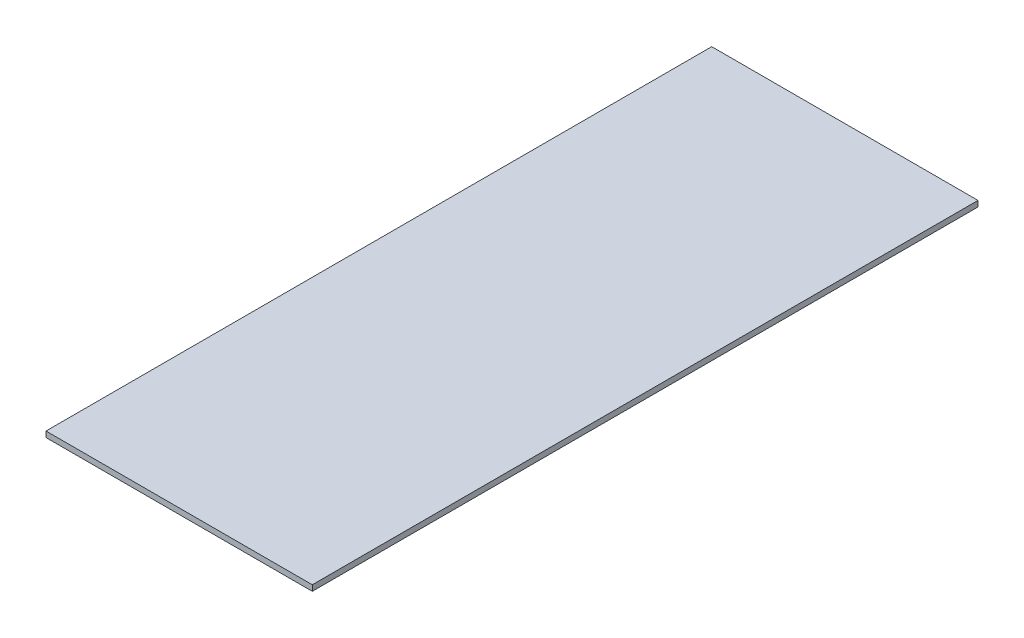
ISO-10303-21;
HEADER;
FILE_DESCRIPTION(('STEP AP214'),'2;1');
FILE_NAME('part.step','',(''),(''),'','','');
FILE_SCHEMA(('AUTOMOTIVE_DESIGN { 1 0 10303 214 1 1 1 1 }'));
ENDSEC;
DATA;
#1=APPLICATION_CONTEXT('core data for automotive mechanical design processes');
#2=APPLICATION_PROTOCOL_DEFINITION('international standard','automotive_design',2000,#1);
#3=PRODUCT_CONTEXT('',#1,'mechanical');
#4=PRODUCT('Part','Part','',(#3));
#5=PRODUCT_RELATED_PRODUCT_CATEGORY('part','',(#4));
#6=PRODUCT_DEFINITION_FORMATION('','',#4);
#7=PRODUCT_DEFINITION_CONTEXT('part definition',#1,'design');
#8=PRODUCT_DEFINITION('design','',#6,#7);
#9=PRODUCT_DEFINITION_SHAPE('','',#8);
#10=(LENGTH_UNIT() NAMED_UNIT(*) SI_UNIT(.MILLI.,.METRE.));
#11=(NAMED_UNIT(*) PLANE_ANGLE_UNIT() SI_UNIT($,.RADIAN.));
#12=(NAMED_UNIT(*) SI_UNIT($,.STERADIAN.) SOLID_ANGLE_UNIT());
#13=UNCERTAINTY_MEASURE_WITH_UNIT(LENGTH_MEASURE(1.E-05),#10,'distance_accuracy_value','');
#14=(GEOMETRIC_REPRESENTATION_CONTEXT(3) GLOBAL_UNCERTAINTY_ASSIGNED_CONTEXT((#13)) GLOBAL_UNIT_ASSIGNED_CONTEXT((#10,
#11,#12)) REPRESENTATION_CONTEXT('',''));
#15=CARTESIAN_POINT('',(0.,0.,0.));
#16=DIRECTION('',(0.,0.,1.));
#17=DIRECTION('',(1.,0.,0.));
#18=AXIS2_PLACEMENT_3D('',#15,#16,#17);
#19=CARTESIAN_POINT('',(0.,3.,0.));
#20=DIRECTION('',(1.,0.,0.));
#21=DIRECTION('',(0.,0.,-1.));
#22=AXIS2_PLACEMENT_3D('',#19,#20,#21);
#23=PLANE('',#22);
#24=DIRECTION('',(0.,0.,1.));
#25=VECTOR('',#24,1.);
#26=CARTESIAN_POINT('',(0.,0.,0.));
#27=LINE('',#26,#25);
#28=CARTESIAN_POINT('',(0.,0.,-350.));
#29=VERTEX_POINT('',#28);
#30=CARTESIAN_POINT('',(0.,0.,0.));
#31=VERTEX_POINT('',#30);
#32=EDGE_CURVE('E99',#29,#31,#27,.T.);
#33=ORIENTED_EDGE('',*,*,#32,.T.);
#34=DIRECTION('',(0.,-1.,0.));
#35=VECTOR('',#34,1.);
#36=CARTESIAN_POINT('',(0.,3.,0.));
#37=LINE('',#36,#35);
#38=CARTESIAN_POINT('',(0.,3.,0.));
#39=VERTEX_POINT('',#38);
#40=EDGE_CURVE('E11',#39,#31,#37,.T.);
#41=ORIENTED_EDGE('',*,*,#40,.F.);
#42=DIRECTION('',(0.,0.,1.));
#43=VECTOR('',#42,1.);
#44=CARTESIAN_POINT('',(0.,3.,0.));
#45=LINE('',#44,#43);
#46=CARTESIAN_POINT('',(0.,3.,-350.));
#47=VERTEX_POINT('',#46);
#48=EDGE_CURVE('E87',#47,#39,#45,.T.);
#49=ORIENTED_EDGE('',*,*,#48,.F.);
#50=DIRECTION('',(0.,-1.,0.));
#51=VECTOR('',#50,1.);
#52=CARTESIAN_POINT('',(0.,3.,-350.));
#53=LINE('',#52,#51);
#54=EDGE_CURVE('E95',#47,#29,#53,.T.);
#55=ORIENTED_EDGE('',*,*,#54,.T.);
#56=EDGE_LOOP('',(#33,#41,#49,#55));
#57=FACE_BOUND('',#56,.T.);
#58=ADVANCED_FACE('F36',(#57),#23,.F.);
#59=CARTESIAN_POINT('',(0.,3.,0.));
#60=DIRECTION('',(0.,0.,-1.));
#61=DIRECTION('',(-1.,0.,0.));
#62=AXIS2_PLACEMENT_3D('',#59,#60,#61);
#63=PLANE('',#62);
#64=DIRECTION('',(1.,0.,0.));
#65=VECTOR('',#64,1.);
#66=CARTESIAN_POINT('',(0.,0.,0.));
#67=LINE('',#66,#65);
#68=CARTESIAN_POINT('',(140.,0.,0.));
#69=VERTEX_POINT('',#68);
#70=EDGE_CURVE('E91',#31,#69,#67,.T.);
#71=ORIENTED_EDGE('',*,*,#70,.T.);
#72=DIRECTION('',(0.,-1.,0.));
#73=VECTOR('',#72,1.);
#74=CARTESIAN_POINT('',(140.,3.,0.));
#75=LINE('',#74,#73);
#76=CARTESIAN_POINT('',(140.,3.,0.));
#77=VERTEX_POINT('',#76);
#78=EDGE_CURVE('E44',#77,#69,#75,.T.);
#79=ORIENTED_EDGE('',*,*,#78,.F.);
#80=DIRECTION('',(1.,0.,0.));
#81=VECTOR('',#80,1.);
#82=CARTESIAN_POINT('',(0.,3.,0.));
#83=LINE('',#82,#81);
#84=EDGE_CURVE('E82',#39,#77,#83,.T.);
#85=ORIENTED_EDGE('',*,*,#84,.F.);
#86=ORIENTED_EDGE('',*,*,#40,.T.);
#87=EDGE_LOOP('',(#71,#79,#85,#86));
#88=FACE_BOUND('',#87,.T.);
#89=ADVANCED_FACE('F90',(#88),#63,.F.);
#90=CARTESIAN_POINT('',(140.,3.,0.));
#91=DIRECTION('',(-1.,0.,0.));
#92=DIRECTION('',(0.,0.,1.));
#93=AXIS2_PLACEMENT_3D('',#90,#91,#92);
#94=PLANE('',#93);
#95=DIRECTION('',(0.,0.,-1.));
#96=VECTOR('',#95,1.);
#97=CARTESIAN_POINT('',(140.,0.,0.));
#98=LINE('',#97,#96);
#99=CARTESIAN_POINT('',(140.,0.,-350.));
#100=VERTEX_POINT('',#99);
#101=EDGE_CURVE('E69',#69,#100,#98,.T.);
#102=ORIENTED_EDGE('',*,*,#101,.T.);
#103=DIRECTION('',(0.,-1.,0.));
#104=VECTOR('',#103,1.);
#105=CARTESIAN_POINT('',(140.,3.,-350.));
#106=LINE('',#105,#104);
#107=CARTESIAN_POINT('',(140.,3.,-350.));
#108=VERTEX_POINT('',#107);
#109=EDGE_CURVE('E92',#108,#100,#106,.T.);
#110=ORIENTED_EDGE('',*,*,#109,.F.);
#111=DIRECTION('',(0.,0.,-1.));
#112=VECTOR('',#111,1.);
#113=CARTESIAN_POINT('',(140.,3.,0.));
#114=LINE('',#113,#112);
#115=EDGE_CURVE('E85',#77,#108,#114,.T.);
#116=ORIENTED_EDGE('',*,*,#115,.F.);
#117=ORIENTED_EDGE('',*,*,#78,.T.);
#118=EDGE_LOOP('',(#102,#110,#116,#117));
#119=FACE_BOUND('',#118,.T.);
#120=ADVANCED_FACE('F93',(#119),#94,.F.);
#121=CARTESIAN_POINT('',(0.,3.,-350.));
#122=DIRECTION('',(0.,0.,1.));
#123=DIRECTION('',(1.,0.,0.));
#124=AXIS2_PLACEMENT_3D('',#121,#122,#123);
#125=PLANE('',#124);
#126=DIRECTION('',(-1.,0.,0.));
#127=VECTOR('',#126,1.);
#128=CARTESIAN_POINT('',(0.,0.,-350.));
#129=LINE('',#128,#127);
#130=EDGE_CURVE('E75',#100,#29,#129,.T.);
#131=ORIENTED_EDGE('',*,*,#130,.T.);
#132=ORIENTED_EDGE('',*,*,#54,.F.);
#133=DIRECTION('',(-1.,0.,0.));
#134=VECTOR('',#133,1.);
#135=CARTESIAN_POINT('',(0.,3.,-350.));
#136=LINE('',#135,#134);
#137=EDGE_CURVE('E52',#108,#47,#136,.T.);
#138=ORIENTED_EDGE('',*,*,#137,.F.);
#139=ORIENTED_EDGE('',*,*,#109,.T.);
#140=EDGE_LOOP('',(#131,#132,#138,#139));
#141=FACE_BOUND('',#140,.T.);
#142=ADVANCED_FACE('F106',(#141),#125,.F.);
#143=CARTESIAN_POINT('',(0.,3.,0.));
#144=DIRECTION('',(0.,-1.,0.));
#145=DIRECTION('',(0.,0.,-1.));
#146=AXIS2_PLACEMENT_3D('',#143,#144,#145);
#147=PLANE('',#146);
#148=ORIENTED_EDGE('',*,*,#48,.T.);
#149=ORIENTED_EDGE('',*,*,#84,.T.);
#150=ORIENTED_EDGE('',*,*,#115,.T.);
#151=ORIENTED_EDGE('',*,*,#137,.T.);
#152=EDGE_LOOP('',(#148,#149,#150,#151));
#153=FACE_BOUND('',#152,.T.);
#154=ADVANCED_FACE('F83',(#153),#147,.F.);
#155=CARTESIAN_POINT('',(0.,0.,0.));
#156=DIRECTION('',(0.,-1.,0.));
#157=DIRECTION('',(0.,0.,-1.));
#158=AXIS2_PLACEMENT_3D('',#155,#156,#157);
#159=PLANE('',#158);
#160=ORIENTED_EDGE('',*,*,#32,.F.);
#161=ORIENTED_EDGE('',*,*,#130,.F.);
#162=ORIENTED_EDGE('',*,*,#101,.F.);
#163=ORIENTED_EDGE('',*,*,#70,.F.);
#164=EDGE_LOOP('',(#160,#161,#162,#163));
#165=FACE_BOUND('',#164,.T.);
#166=ADVANCED_FACE('F109',(#165),#159,.T.);
#167=CLOSED_SHELL('',(#58,#89,#120,#142,#154,#166));
#168=MANIFOLD_SOLID_BREP('B2',#167);
#169=ADVANCED_BREP_SHAPE_REPRESENTATION('',(#18,#168),#14);
#170=SHAPE_DEFINITION_REPRESENTATION(#9,#169);
ENDSEC;
END-ISO-10303-21;
